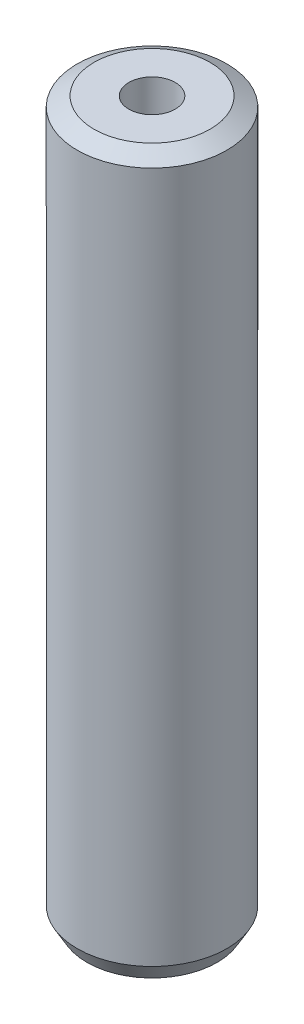
ISO-10303-21;
HEADER;
FILE_DESCRIPTION(('STEP AP214'),'2;1');
FILE_NAME('part.step','',(''),(''),'','','');
FILE_SCHEMA(('AUTOMOTIVE_DESIGN { 1 0 10303 214 1 1 1 1 }'));
ENDSEC;
DATA;
#1=APPLICATION_CONTEXT('core data for automotive mechanical design processes');
#2=APPLICATION_PROTOCOL_DEFINITION('international standard','automotive_design',2000,#1);
#3=PRODUCT_CONTEXT('',#1,'mechanical');
#4=PRODUCT('Part','Part','',(#3));
#5=PRODUCT_RELATED_PRODUCT_CATEGORY('part','',(#4));
#6=PRODUCT_DEFINITION_FORMATION('','',#4);
#7=PRODUCT_DEFINITION_CONTEXT('part definition',#1,'design');
#8=PRODUCT_DEFINITION('design','',#6,#7);
#9=PRODUCT_DEFINITION_SHAPE('','',#8);
#10=(LENGTH_UNIT() NAMED_UNIT(*) SI_UNIT(.MILLI.,.METRE.));
#11=(NAMED_UNIT(*) PLANE_ANGLE_UNIT() SI_UNIT($,.RADIAN.));
#12=(NAMED_UNIT(*) SI_UNIT($,.STERADIAN.) SOLID_ANGLE_UNIT());
#13=UNCERTAINTY_MEASURE_WITH_UNIT(LENGTH_MEASURE(1.E-05),#10,'distance_accuracy_value','');
#14=(GEOMETRIC_REPRESENTATION_CONTEXT(3) GLOBAL_UNCERTAINTY_ASSIGNED_CONTEXT((#13)) GLOBAL_UNIT_ASSIGNED_CONTEXT((#10,
#11,#12)) REPRESENTATION_CONTEXT('',''));
#15=CARTESIAN_POINT('',(0.,0.,0.));
#16=DIRECTION('',(0.,0.,1.));
#17=DIRECTION('',(1.,0.,0.));
#18=AXIS2_PLACEMENT_3D('',#15,#16,#17);
#19=CARTESIAN_POINT('',(0.,359.790026666591,0.));
#20=DIRECTION('',(0.,-1.,0.));
#21=DIRECTION('',(0.,0.,-1.));
#22=AXIS2_PLACEMENT_3D('',#19,#20,#21);
#23=CYLINDRICAL_SURFACE('',#22,37.5);
#24=CARTESIAN_POINT('',(0.,354.914974262951,0.));
#25=DIRECTION('',(0.,1.,0.));
#26=DIRECTION('',(0.,0.,1.));
#27=AXIS2_PLACEMENT_3D('',#24,#25,#26);
#28=CIRCLE('',#27,37.5);
#29=CARTESIAN_POINT('',(0.,354.914974262951,-37.5));
#30=VERTEX_POINT('',#29);
#31=EDGE_CURVE('E50',#30,#30,#28,.F.);
#32=CARTESIAN_POINT('',(0.,8.44383845266627,0.));
#33=DIRECTION('',(0.,1.,0.));
#34=DIRECTION('',(0.,0.,1.));
#35=AXIS2_PLACEMENT_3D('',#32,#33,#34);
#36=CIRCLE('',#35,37.5);
#37=CARTESIAN_POINT('',(0.,8.44383845266622,-37.5));
#38=VERTEX_POINT('',#37);
#39=EDGE_CURVE('E51',#38,#38,#36,.T.);
#40=CARTESIAN_POINT('',(0.,354.914974262951,-37.5));
#41=CARTESIAN_POINT('',(0.,351.305899931594,-37.5));
#42=CARTESIAN_POINT('',(0.,347.696825600237,-37.5));
#43=CARTESIAN_POINT('',(0.,340.478676937523,-37.5));
#44=CARTESIAN_POINT('',(0.,336.869602606166,-37.5));
#45=CARTESIAN_POINT('',(0.,329.651453943451,-37.5));
#46=CARTESIAN_POINT('',(0.,326.042379612094,-37.5));
#47=CARTESIAN_POINT('',(0.,318.82423094938,-37.5));
#48=CARTESIAN_POINT('',(0.,315.215156618023,-37.5));
#49=CARTESIAN_POINT('',(0.,307.997007955308,-37.5));
#50=CARTESIAN_POINT('',(0.,304.387933623951,-37.5));
#51=CARTESIAN_POINT('',(0.,297.169784961237,-37.5));
#52=CARTESIAN_POINT('',(0.,293.56071062988,-37.5));
#53=CARTESIAN_POINT('',(0.,286.342561967166,-37.5));
#54=CARTESIAN_POINT('',(0.,282.733487635809,-37.5));
#55=CARTESIAN_POINT('',(0.,275.515338973094,-37.5));
#56=CARTESIAN_POINT('',(0.,271.906264641737,-37.5));
#57=CARTESIAN_POINT('',(0.,264.688115979023,-37.5));
#58=CARTESIAN_POINT('',(0.,261.079041647666,-37.5));
#59=CARTESIAN_POINT('',(0.,253.860892984951,-37.5));
#60=CARTESIAN_POINT('',(0.,250.251818653594,-37.5));
#61=CARTESIAN_POINT('',(0.,243.03366999088,-37.5));
#62=CARTESIAN_POINT('',(0.,239.424595659523,-37.5));
#63=CARTESIAN_POINT('',(0.,232.206446996809,-37.5));
#64=CARTESIAN_POINT('',(0.,228.597372665451,-37.5));
#65=CARTESIAN_POINT('',(0.,221.379224002737,-37.5));
#66=CARTESIAN_POINT('',(0.,217.77014967138,-37.5));
#67=CARTESIAN_POINT('',(0.,210.552001008666,-37.5));
#68=CARTESIAN_POINT('',(0.,206.942926677309,-37.5));
#69=CARTESIAN_POINT('',(0.,199.724778014594,-37.5));
#70=CARTESIAN_POINT('',(0.,196.115703683237,-37.5));
#71=CARTESIAN_POINT('',(0.,188.897555020523,-37.5));
#72=CARTESIAN_POINT('',(0.,185.288480689166,-37.5));
#73=CARTESIAN_POINT('',(0.,178.070332026452,-37.5));
#74=CARTESIAN_POINT('',(0.,174.461257695094,-37.5));
#75=CARTESIAN_POINT('',(0.,167.24310903238,-37.5));
#76=CARTESIAN_POINT('',(0.,163.634034701023,-37.5));
#77=CARTESIAN_POINT('',(0.,156.415886038309,-37.5));
#78=CARTESIAN_POINT('',(0.,152.806811706952,-37.5));
#79=CARTESIAN_POINT('',(0.,145.588663044237,-37.5));
#80=CARTESIAN_POINT('',(0.,141.97958871288,-37.5));
#81=CARTESIAN_POINT('',(0.,134.761440050166,-37.5));
#82=CARTESIAN_POINT('',(0.,131.152365718809,-37.5));
#83=CARTESIAN_POINT('',(0.,123.934217056095,-37.5));
#84=CARTESIAN_POINT('',(0.,120.325142724737,-37.5));
#85=CARTESIAN_POINT('',(0.,113.106994062023,-37.5));
#86=CARTESIAN_POINT('',(0.,109.497919730666,-37.5));
#87=CARTESIAN_POINT('',(0.,102.279771067952,-37.5));
#88=CARTESIAN_POINT('',(0.,98.6706967365946,-37.5));
#89=CARTESIAN_POINT('',(0.,91.4525480738804,-37.5));
#90=CARTESIAN_POINT('',(0.,87.8434737425232,-37.5));
#91=CARTESIAN_POINT('',(0.,80.625325079809,-37.5));
#92=CARTESIAN_POINT('',(0.,77.0162507484518,-37.5));
#93=CARTESIAN_POINT('',(0.,69.7981020857375,-37.5));
#94=CARTESIAN_POINT('',(0.,66.1890277543804,-37.5));
#95=CARTESIAN_POINT('',(0.,58.9708790916661,-37.5));
#96=CARTESIAN_POINT('',(0.,55.361804760309,-37.5));
#97=CARTESIAN_POINT('',(0.,48.1436560975947,-37.5));
#98=CARTESIAN_POINT('',(0.,44.5345817662376,-37.5));
#99=CARTESIAN_POINT('',(0.,37.3164331035233,-37.5));
#100=CARTESIAN_POINT('',(0.,33.7073587721662,-37.5));
#101=CARTESIAN_POINT('',(0.,26.4892101094519,-37.5));
#102=CARTESIAN_POINT('',(0.,22.8801357780948,-37.5));
#103=CARTESIAN_POINT('',(0.,15.6619871153805,-37.5));
#104=CARTESIAN_POINT('',(0.,12.0529127840234,-37.5));
#105=CARTESIAN_POINT('',(0.,8.44383845266622,-37.5));
#106=B_SPLINE_CURVE_WITH_KNOTS('',3,(#40,#41,#42,#43,#44,#45,#46,#47,#48,#49,#50,#51,#52,#53,
#54,#55,#56,#57,#58,#59,#60,#61,#62,#63,#64,#65,#66,#67,#68,#69,#70,#71,#72,#73,#74,#75,#76,#77,
#78,#79,#80,#81,#82,#83,#84,#85,#86,#87,#88,#89,#90,#91,#92,#93,#94,#95,#96,#97,#98,#99,#100,
#101,#102,#103,#104,#105),.UNSPECIFIED.,.F.,.F.,(4,2,2,2,2,2,2,2,2,2,2,2,2,2,2,2,2,2,2,2,2,2,2,
2,2,2,2,2,2,2,2,2,4),(0.,10.8272229940714,21.6544459881428,32.4816689822142,43.3088919762856,
54.136114970357,64.9633379644284,75.7905609584998,86.6177839525712,97.4450069466426,
108.272229940714,119.099452934785,129.926675928857,140.753898922928,151.581121917,
162.408344911071,173.235567905142,184.062790899214,194.890013893285,205.717236887357,
216.544459881428,227.3716828755,238.198905869571,249.026128863642,259.853351857714,
270.680574851785,281.507797845857,292.335020839928,303.162243833999,313.989466828071,
324.816689822142,335.643912816214,346.471135810285),.UNSPECIFIED.);
#107=EDGE_CURVE('BSEAM39',#30,#38,#106,.T.);
#108=ORIENTED_EDGE('',*,*,#31,.T.);
#109=ORIENTED_EDGE('',*,*,#39,.T.);
#110=ORIENTED_EDGE('',*,*,#107,.T.);
#111=ORIENTED_EDGE('',*,*,#107,.F.);
#112=EDGE_LOOP('',(#108,#110,#109,#111));
#113=FACE_BOUND('',#112,.T.);
#114=ADVANCED_FACE('F39',(#113),#23,.T.);
#115=CARTESIAN_POINT('',(0.,359.790026666591,0.));
#116=DIRECTION('',(0.,1.,0.));
#117=DIRECTION('',(0.,0.,1.));
#118=AXIS2_PLACEMENT_3D('',#115,#116,#117);
#119=PLANE('',#118);
#120=CARTESIAN_POINT('',(0.,359.790026666591,0.));
#121=DIRECTION('',(0.,1.,0.));
#122=DIRECTION('',(0.,0.,1.));
#123=AXIS2_PLACEMENT_3D('',#120,#121,#122);
#124=CIRCLE('',#123,29.0561615473346);
#125=CARTESIAN_POINT('',(0.,359.790026666591,29.0561615473346));
#126=VERTEX_POINT('',#125);
#127=EDGE_CURVE('E54',#126,#126,#124,.T.);
#128=ORIENTED_EDGE('',*,*,#127,.T.);
#129=EDGE_LOOP('',(#128));
#130=FACE_BOUND('',#129,.T.);
#131=CARTESIAN_POINT('',(0.,359.790026666591,0.));
#132=DIRECTION('',(0.,1.,0.));
#133=DIRECTION('',(0.,0.,1.));
#134=AXIS2_PLACEMENT_3D('',#131,#132,#133);
#135=CIRCLE('',#134,11.6189836391045);
#136=CARTESIAN_POINT('',(0.,359.790026666591,-11.6189836391045));
#137=VERTEX_POINT('',#136);
#138=EDGE_CURVE('E58',#137,#137,#135,.T.);
#139=ORIENTED_EDGE('',*,*,#138,.F.);
#140=EDGE_LOOP('',(#139));
#141=FACE_BOUND('',#140,.T.);
#142=ADVANCED_FACE('F69',(#130,#141),#119,.T.);
#143=CARTESIAN_POINT('',(0.,0.,0.));
#144=DIRECTION('',(0.,1.,0.));
#145=DIRECTION('',(0.,0.,1.));
#146=AXIS2_PLACEMENT_3D('',#143,#144,#145);
#147=PLANE('',#146);
#148=CARTESIAN_POINT('',(0.,0.,0.));
#149=DIRECTION('',(0.,1.,0.));
#150=DIRECTION('',(0.,0.,1.));
#151=AXIS2_PLACEMENT_3D('',#148,#149,#150);
#152=CIRCLE('',#151,32.6249475963594);
#153=CARTESIAN_POINT('',(0.,0.,32.6249475963594));
#154=VERTEX_POINT('',#153);
#155=EDGE_CURVE('E10',#154,#154,#152,.F.);
#156=ORIENTED_EDGE('',*,*,#155,.T.);
#157=EDGE_LOOP('',(#156));
#158=FACE_BOUND('',#157,.T.);
#159=CARTESIAN_POINT('',(0.,0.,0.));
#160=DIRECTION('',(0.,1.,0.));
#161=DIRECTION('',(0.,0.,1.));
#162=AXIS2_PLACEMENT_3D('',#159,#160,#161);
#163=CIRCLE('',#162,11.6189836391045);
#164=CARTESIAN_POINT('',(0.,0.,-11.6189836391045));
#165=VERTEX_POINT('',#164);
#166=EDGE_CURVE('E63',#165,#165,#163,.T.);
#167=ORIENTED_EDGE('',*,*,#166,.T.);
#168=EDGE_LOOP('',(#167));
#169=FACE_BOUND('',#168,.T.);
#170=ADVANCED_FACE('F75',(#158,#169),#147,.F.);
#171=CARTESIAN_POINT('',(0.,359.790026666591,0.));
#172=DIRECTION('',(0.,-1.,0.));
#173=DIRECTION('',(0.,0.,-1.));
#174=AXIS2_PLACEMENT_3D('',#171,#172,#173);
#175=CYLINDRICAL_SURFACE('',#174,11.6189836391045);
#176=CARTESIAN_POINT('',(0.,359.790026666591,-11.6189836391045));
#177=CARTESIAN_POINT('',(0.,356.042213888814,-11.6189836391045));
#178=CARTESIAN_POINT('',(0.,352.294401111037,-11.6189836391045));
#179=CARTESIAN_POINT('',(0.,344.798775555483,-11.6189836391045));
#180=CARTESIAN_POINT('',(0.,341.050962777706,-11.6189836391045));
#181=CARTESIAN_POINT('',(0.,333.555337222152,-11.6189836391045));
#182=CARTESIAN_POINT('',(0.,329.807524444375,-11.6189836391045));
#183=CARTESIAN_POINT('',(0.,322.311898888821,-11.6189836391045));
#184=CARTESIAN_POINT('',(0.,318.564086111044,-11.6189836391045));
#185=CARTESIAN_POINT('',(0.,311.06846055549,-11.6189836391045));
#186=CARTESIAN_POINT('',(0.,307.320647777713,-11.6189836391045));
#187=CARTESIAN_POINT('',(0.,299.825022222159,-11.6189836391045));
#188=CARTESIAN_POINT('',(0.,296.077209444382,-11.6189836391045));
#189=CARTESIAN_POINT('',(0.,288.581583888828,-11.6189836391045));
#190=CARTESIAN_POINT('',(0.,284.833771111051,-11.6189836391045));
#191=CARTESIAN_POINT('',(0.,277.338145555497,-11.6189836391045));
#192=CARTESIAN_POINT('',(0.,273.59033277772,-11.6189836391045));
#193=CARTESIAN_POINT('',(0.,266.094707222167,-11.6189836391045));
#194=CARTESIAN_POINT('',(0.,262.346894444389,-11.6189836391045));
#195=CARTESIAN_POINT('',(0.,254.851268888835,-11.6189836391045));
#196=CARTESIAN_POINT('',(0.,251.103456111059,-11.6189836391045));
#197=CARTESIAN_POINT('',(0.,243.607830555504,-11.6189836391045));
#198=CARTESIAN_POINT('',(0.,239.860017777728,-11.6189836391045));
#199=CARTESIAN_POINT('',(0.,232.364392222174,-11.6189836391045));
#200=CARTESIAN_POINT('',(0.,228.616579444397,-11.6189836391045));
#201=CARTESIAN_POINT('',(0.,221.120953888843,-11.6189836391045));
#202=CARTESIAN_POINT('',(0.,217.373141111066,-11.6189836391045));
#203=CARTESIAN_POINT('',(0.,209.877515555512,-11.6189836391045));
#204=CARTESIAN_POINT('',(0.,206.129702777735,-11.6189836391045));
#205=CARTESIAN_POINT('',(0.,198.634077222181,-11.6189836391045));
#206=CARTESIAN_POINT('',(0.,194.886264444404,-11.6189836391045));
#207=CARTESIAN_POINT('',(0.,187.39063888885,-11.6189836391045));
#208=CARTESIAN_POINT('',(0.,183.642826111073,-11.6189836391045));
#209=CARTESIAN_POINT('',(0.,176.147200555519,-11.6189836391045));
#210=CARTESIAN_POINT('',(0.,172.399387777742,-11.6189836391045));
#211=CARTESIAN_POINT('',(0.,164.903762222188,-11.6189836391045));
#212=CARTESIAN_POINT('',(0.,161.155949444411,-11.6189836391045));
#213=CARTESIAN_POINT('',(0.,153.660323888857,-11.6189836391045));
#214=CARTESIAN_POINT('',(0.,149.91251111108,-11.6189836391045));
#215=CARTESIAN_POINT('',(0.,142.416885555526,-11.6189836391045));
#216=CARTESIAN_POINT('',(0.,138.669072777749,-11.6189836391045));
#217=CARTESIAN_POINT('',(0.,131.173447222195,-11.6189836391045));
#218=CARTESIAN_POINT('',(0.,127.425634444418,-11.6189836391045));
#219=CARTESIAN_POINT('',(0.,119.930008888864,-11.6189836391045));
#220=CARTESIAN_POINT('',(0.,116.182196111087,-11.6189836391045));
#221=CARTESIAN_POINT('',(0.,108.686570555533,-11.6189836391045));
#222=CARTESIAN_POINT('',(0.,104.938757777756,-11.6189836391045));
#223=CARTESIAN_POINT('',(0.,97.4431322222018,-11.6189836391045));
#224=CARTESIAN_POINT('',(0.,93.6953194444248,-11.6189836391045));
#225=CARTESIAN_POINT('',(0.,86.1996938888708,-11.6189836391045));
#226=CARTESIAN_POINT('',(0.,82.4518811110938,-11.6189836391045));
#227=CARTESIAN_POINT('',(0.,74.9562555555399,-11.6189836391045));
#228=CARTESIAN_POINT('',(0.,71.2084427777629,-11.6189836391045));
#229=CARTESIAN_POINT('',(0.,63.7128172222089,-11.6189836391045));
#230=CARTESIAN_POINT('',(0.,59.9650044444318,-11.6189836391045));
#231=CARTESIAN_POINT('',(0.,52.4693788888778,-11.6189836391045));
#232=CARTESIAN_POINT('',(0.,48.7215661111009,-11.6189836391045));
#233=CARTESIAN_POINT('',(0.,41.2259405555469,-11.6189836391045));
#234=CARTESIAN_POINT('',(0.,37.4781277777699,-11.6189836391045));
#235=CARTESIAN_POINT('',(0.,29.9825022222159,-11.6189836391045));
#236=CARTESIAN_POINT('',(0.,26.2346894444389,-11.6189836391045));
#237=CARTESIAN_POINT('',(0.,18.7390638888849,-11.6189836391045));
#238=CARTESIAN_POINT('',(0.,14.9912511111079,-11.6189836391045));
#239=CARTESIAN_POINT('',(0.,7.49562555555392,-11.6189836391045));
#240=CARTESIAN_POINT('',(0.,3.74781277777693,-11.6189836391045));
#241=CARTESIAN_POINT('',(0.,0.,-11.6189836391045));
#242=B_SPLINE_CURVE_WITH_KNOTS('',3,(#176,#177,#178,#179,#180,#181,#182,#183,#184,#185,#186,
#187,#188,#189,#190,#191,#192,#193,#194,#195,#196,#197,#198,#199,#200,#201,#202,#203,#204,#205,
#206,#207,#208,#209,#210,#211,#212,#213,#214,#215,#216,#217,#218,#219,#220,#221,#222,#223,#224,
#225,#226,#227,#228,#229,#230,#231,#232,#233,#234,#235,#236,#237,#238,#239,#240,#241),
.UNSPECIFIED.,.F.,.F.,(4,2,2,2,2,2,2,2,2,2,2,2,2,2,2,2,2,2,2,2,2,2,2,2,2,2,2,2,2,2,2,2,4),(0.,
11.243438333331,22.486876666662,33.730314999993,44.9737533333239,56.217191666655,
67.4606299999859,78.7040683333169,89.9475066666479,101.190944999979,112.43438333331,
123.677821666641,134.921259999972,146.164698333303,157.408136666634,168.651574999965,
179.895013333296,191.138451666627,202.381889999958,213.625328333289,224.86876666662,
236.112204999951,247.355643333282,258.599081666613,269.842519999944,281.085958333275,
292.329396666605,303.572834999937,314.816273333267,326.059711666598,337.303149999929,
348.54658833326,359.790026666591),.UNSPECIFIED.);
#243=EDGE_CURVE('BSEAM70',#137,#165,#242,.T.);
#244=ORIENTED_EDGE('',*,*,#138,.T.);
#245=ORIENTED_EDGE('',*,*,#166,.F.);
#246=ORIENTED_EDGE('',*,*,#243,.T.);
#247=ORIENTED_EDGE('',*,*,#243,.F.);
#248=EDGE_LOOP('',(#244,#246,#245,#247));
#249=FACE_BOUND('',#248,.T.);
#250=ADVANCED_FACE('F70',(#249),#175,.F.);
#251=CARTESIAN_POINT('',(0.,359.790026666591,0.));
#252=DIRECTION('',(0.,-1.,0.));
#253=DIRECTION('',(0.,0.,-1.));
#254=AXIS2_PLACEMENT_3D('',#251,#252,#253);
#255=CONICAL_SURFACE('',#254,29.0561615473346,1.04719755119659);
#256=ORIENTED_EDGE('',*,*,#31,.F.);
#257=EDGE_LOOP('',(#256));
#258=FACE_BOUND('',#257,.T.);
#259=ORIENTED_EDGE('',*,*,#127,.F.);
#260=EDGE_LOOP('',(#259));
#261=FACE_BOUND('',#260,.T.);
#262=ADVANCED_FACE('F81',(#258,#261),#255,.T.);
#263=CARTESIAN_POINT('',(0.,8.44383845266627,0.));
#264=DIRECTION('',(0.,1.,0.));
#265=DIRECTION('',(0.,0.,1.));
#266=AXIS2_PLACEMENT_3D('',#263,#264,#265);
#267=CONICAL_SURFACE('',#266,37.5,0.523598775598302);
#268=ORIENTED_EDGE('',*,*,#155,.F.);
#269=EDGE_LOOP('',(#268));
#270=FACE_BOUND('',#269,.T.);
#271=ORIENTED_EDGE('',*,*,#39,.F.);
#272=EDGE_LOOP('',(#271));
#273=FACE_BOUND('',#272,.T.);
#274=ADVANCED_FACE('F45',(#270,#273),#267,.T.);
#275=CLOSED_SHELL('',(#114,#142,#170,#250,#262,#274));
#276=MANIFOLD_SOLID_BREP('B2',#275);
#277=ADVANCED_BREP_SHAPE_REPRESENTATION('',(#18,#276),#14);
#278=SHAPE_DEFINITION_REPRESENTATION(#9,#277);
ENDSEC;
END-ISO-10303-21;
